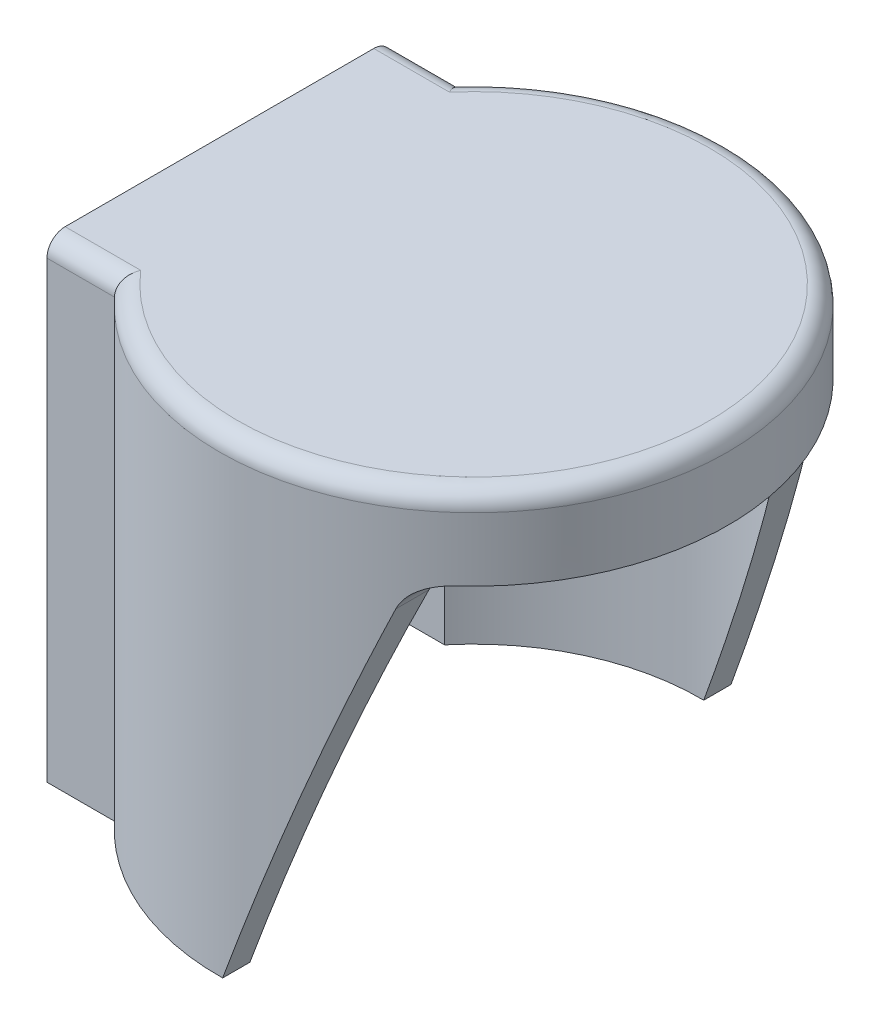
ISO-10303-21;
HEADER;
FILE_DESCRIPTION(('STEP AP214'),'2;1');
FILE_NAME('part.step','',(''),(''),'','','');
FILE_SCHEMA(('AUTOMOTIVE_DESIGN { 1 0 10303 214 1 1 1 1 }'));
ENDSEC;
DATA;
#1=APPLICATION_CONTEXT('core data for automotive mechanical design processes');
#2=APPLICATION_PROTOCOL_DEFINITION('international standard','automotive_design',2000,#1);
#3=PRODUCT_CONTEXT('',#1,'mechanical');
#4=PRODUCT('Part','Part','',(#3));
#5=PRODUCT_RELATED_PRODUCT_CATEGORY('part','',(#4));
#6=PRODUCT_DEFINITION_FORMATION('','',#4);
#7=PRODUCT_DEFINITION_CONTEXT('part definition',#1,'design');
#8=PRODUCT_DEFINITION('design','',#6,#7);
#9=PRODUCT_DEFINITION_SHAPE('','',#8);
#10=(LENGTH_UNIT() NAMED_UNIT(*) SI_UNIT(.MILLI.,.METRE.));
#11=(NAMED_UNIT(*) PLANE_ANGLE_UNIT() SI_UNIT($,.RADIAN.));
#12=(NAMED_UNIT(*) SI_UNIT($,.STERADIAN.) SOLID_ANGLE_UNIT());
#13=UNCERTAINTY_MEASURE_WITH_UNIT(LENGTH_MEASURE(1.E-05),#10,'distance_accuracy_value','');
#14=(GEOMETRIC_REPRESENTATION_CONTEXT(3) GLOBAL_UNCERTAINTY_ASSIGNED_CONTEXT((#13)) GLOBAL_UNIT_ASSIGNED_CONTEXT((#10,
#11,#12)) REPRESENTATION_CONTEXT('',''));
#15=CARTESIAN_POINT('',(0.,0.,0.));
#16=DIRECTION('',(0.,0.,1.));
#17=DIRECTION('',(1.,0.,0.));
#18=AXIS2_PLACEMENT_3D('',#15,#16,#17);
#19=CARTESIAN_POINT('',(0.,0.,0.));
#20=DIRECTION('',(0.,1.,0.));
#21=DIRECTION('',(0.,0.,1.));
#22=AXIS2_PLACEMENT_3D('',#19,#20,#21);
#23=PLANE('',#22);
#24=CARTESIAN_POINT('',(0.,0.,0.));
#25=DIRECTION('',(0.,1.,0.));
#26=DIRECTION('',(0.,0.,1.));
#27=AXIS2_PLACEMENT_3D('',#24,#25,#26);
#28=CIRCLE('',#27,14.);
#29=CARTESIAN_POINT('',(0.174639963276733,0.,-13.9989107034521));
#30=VERTEX_POINT('',#29);
#31=CARTESIAN_POINT('',(-10.2834819006016,0.,-9.5));
#32=VERTEX_POINT('',#31);
#33=EDGE_CURVE('E275',#30,#32,#28,.T.);
#34=ORIENTED_EDGE('',*,*,#33,.F.);
#35=DIRECTION('',(0.,0.,1.));
#36=VECTOR('',#35,1.);
#37=CARTESIAN_POINT('',(0.174639963276733,0.,-14.));
#38=LINE('',#37,#36);
#39=CARTESIAN_POINT('',(0.174639963276733,0.,-12.4987799757907));
#40=VERTEX_POINT('',#39);
#41=EDGE_CURVE('E165',#30,#40,#38,.T.);
#42=ORIENTED_EDGE('',*,*,#41,.T.);
#43=CARTESIAN_POINT('',(0.,0.,0.));
#44=DIRECTION('',(0.,1.,0.));
#45=DIRECTION('',(0.,0.,1.));
#46=AXIS2_PLACEMENT_3D('',#43,#44,#45);
#47=CIRCLE('',#46,12.5);
#48=CARTESIAN_POINT('',(-9.60468635614928,0.,-8.));
#49=VERTEX_POINT('',#48);
#50=EDGE_CURVE('E293',#40,#49,#47,.T.);
#51=ORIENTED_EDGE('',*,*,#50,.T.);
#52=DIRECTION('',(1.,0.,0.));
#53=VECTOR('',#52,1.);
#54=CARTESIAN_POINT('',(0.,0.,-8.));
#55=LINE('',#54,#53);
#56=CARTESIAN_POINT('',(-14.,0.,-8.));
#57=VERTEX_POINT('',#56);
#58=EDGE_CURVE('E352',#57,#49,#55,.T.);
#59=ORIENTED_EDGE('',*,*,#58,.F.);
#60=DIRECTION('',(0.,0.,-1.));
#61=VECTOR('',#60,1.);
#62=CARTESIAN_POINT('',(-14.,0.,9.5));
#63=LINE('',#62,#61);
#64=CARTESIAN_POINT('',(-14.,0.,-9.5));
#65=VERTEX_POINT('',#64);
#66=EDGE_CURVE('E347',#57,#65,#63,.T.);
#67=ORIENTED_EDGE('',*,*,#66,.T.);
#68=DIRECTION('',(1.,0.,0.));
#69=VECTOR('',#68,1.);
#70=CARTESIAN_POINT('',(0.,0.,-9.5));
#71=LINE('',#70,#69);
#72=EDGE_CURVE('E279',#65,#32,#71,.T.);
#73=ORIENTED_EDGE('',*,*,#72,.T.);
#74=EDGE_LOOP('',(#34,#42,#51,#59,#67,#73));
#75=FACE_BOUND('',#74,.T.);
#76=ADVANCED_FACE('F37',(#75),#23,.F.);
#77=CARTESIAN_POINT('',(-14.,0.,9.5));
#78=DIRECTION('',(1.,0.,0.));
#79=DIRECTION('',(0.,0.,-1.));
#80=AXIS2_PLACEMENT_3D('',#77,#78,#79);
#81=PLANE('',#80);
#82=DIRECTION('',(0.,0.,-1.));
#83=VECTOR('',#82,1.);
#84=CARTESIAN_POINT('',(-14.,26.,9.5));
#85=LINE('',#84,#83);
#86=CARTESIAN_POINT('',(-14.,26.,8.5));
#87=VERTEX_POINT('',#86);
#88=CARTESIAN_POINT('',(-14.,26.,-8.5));
#89=VERTEX_POINT('',#88);
#90=EDGE_CURVE('E358',#87,#89,#85,.T.);
#91=ORIENTED_EDGE('',*,*,#90,.T.);
#92=CARTESIAN_POINT('',(-14.,25.,-8.5));
#93=DIRECTION('',(1.,0.,0.));
#94=DIRECTION('',(0.,0.,-1.));
#95=AXIS2_PLACEMENT_3D('',#92,#93,#94);
#96=CIRCLE('',#95,1.);
#97=CARTESIAN_POINT('',(-14.,25.,-9.5));
#98=VERTEX_POINT('',#97);
#99=EDGE_CURVE('E308',#89,#98,#96,.F.);
#100=ORIENTED_EDGE('',*,*,#99,.T.);
#101=DIRECTION('',(0.,-1.,0.));
#102=VECTOR('',#101,1.);
#103=CARTESIAN_POINT('',(-14.,0.,-9.5));
#104=LINE('',#103,#102);
#105=EDGE_CURVE('E349',#98,#65,#104,.T.);
#106=ORIENTED_EDGE('',*,*,#105,.T.);
#107=ORIENTED_EDGE('',*,*,#66,.F.);
#108=DIRECTION('',(0.,-1.,0.));
#109=VECTOR('',#108,1.);
#110=CARTESIAN_POINT('',(-14.,0.,-8.));
#111=LINE('',#110,#109);
#112=CARTESIAN_POINT('',(-14.,24.5,-8.));
#113=VERTEX_POINT('',#112);
#114=EDGE_CURVE('E365',#113,#57,#111,.T.);
#115=ORIENTED_EDGE('',*,*,#114,.F.);
#116=DIRECTION('',(0.,0.,-1.));
#117=VECTOR('',#116,1.);
#118=CARTESIAN_POINT('',(-14.,24.5,0.));
#119=LINE('',#118,#117);
#120=CARTESIAN_POINT('',(-14.,24.5,8.));
#121=VERTEX_POINT('',#120);
#122=EDGE_CURVE('E373',#121,#113,#119,.T.);
#123=ORIENTED_EDGE('',*,*,#122,.F.);
#124=DIRECTION('',(0.,-1.,0.));
#125=VECTOR('',#124,1.);
#126=CARTESIAN_POINT('',(-14.,0.,8.));
#127=LINE('',#126,#125);
#128=CARTESIAN_POINT('',(-14.,0.,8.));
#129=VERTEX_POINT('',#128);
#130=EDGE_CURVE('E366',#121,#129,#127,.T.);
#131=ORIENTED_EDGE('',*,*,#130,.T.);
#132=CARTESIAN_POINT('',(-14.,0.,9.5));
#133=VERTEX_POINT('',#132);
#134=EDGE_CURVE('E343',#133,#129,#63,.T.);
#135=ORIENTED_EDGE('',*,*,#134,.F.);
#136=DIRECTION('',(0.,-1.,0.));
#137=VECTOR('',#136,1.);
#138=CARTESIAN_POINT('',(-14.,0.,9.5));
#139=LINE('',#138,#137);
#140=CARTESIAN_POINT('',(-14.,25.,9.5));
#141=VERTEX_POINT('',#140);
#142=EDGE_CURVE('E337',#141,#133,#139,.T.);
#143=ORIENTED_EDGE('',*,*,#142,.F.);
#144=CARTESIAN_POINT('',(-14.,25.,8.5));
#145=DIRECTION('',(1.,0.,0.));
#146=DIRECTION('',(0.,0.,-1.));
#147=AXIS2_PLACEMENT_3D('',#144,#145,#146);
#148=CIRCLE('',#147,1.);
#149=EDGE_CURVE('E306',#141,#87,#148,.F.);
#150=ORIENTED_EDGE('',*,*,#149,.T.);
#151=EDGE_LOOP('',(#91,#100,#106,#107,#115,#123,#131,#135,#143,#150));
#152=FACE_BOUND('',#151,.T.);
#153=ADVANCED_FACE('F255',(#152),#81,.F.);
#154=CARTESIAN_POINT('',(0.,26.,0.));
#155=DIRECTION('',(0.,-1.,0.));
#156=DIRECTION('',(0.,0.,-1.));
#157=AXIS2_PLACEMENT_3D('',#154,#155,#156);
#158=CYLINDRICAL_SURFACE('',#157,14.);
#159=DIRECTION('',(0.,-1.,0.));
#160=VECTOR('',#159,1.);
#161=CARTESIAN_POINT('',(-10.2834819006016,26.,-9.5));
#162=LINE('',#161,#160);
#163=CARTESIAN_POINT('',(-10.2834819006016,25.,-9.5));
#164=VERTEX_POINT('',#163);
#165=EDGE_CURVE('E284',#164,#32,#162,.T.);
#166=ORIENTED_EDGE('',*,*,#165,.F.);
#167=CARTESIAN_POINT('',(0.,25.,0.));
#168=DIRECTION('',(0.,1.,0.));
#169=DIRECTION('',(0.,0.,1.));
#170=AXIS2_PLACEMENT_3D('',#167,#168,#169);
#171=CIRCLE('',#170,14.);
#172=CARTESIAN_POINT('',(-10.2834819006016,25.,9.5));
#173=VERTEX_POINT('',#172);
#174=EDGE_CURVE('E11',#164,#173,#171,.F.);
#175=ORIENTED_EDGE('',*,*,#174,.T.);
#176=DIRECTION('',(0.,-1.,0.));
#177=VECTOR('',#176,1.);
#178=CARTESIAN_POINT('',(-10.2834819006016,26.,9.5));
#179=LINE('',#178,#177);
#180=CARTESIAN_POINT('',(-10.2834819006016,0.,9.5));
#181=VERTEX_POINT('',#180);
#182=EDGE_CURVE('E281',#173,#181,#179,.T.);
#183=ORIENTED_EDGE('',*,*,#182,.T.);
#184=CARTESIAN_POINT('',(0.174639963276733,0.,13.9989107034521));
#185=VERTEX_POINT('',#184);
#186=EDGE_CURVE('E280',#181,#185,#28,.T.);
#187=ORIENTED_EDGE('',*,*,#186,.T.);
#188=CARTESIAN_POINT('',(0.,-0.479819355637217,0.));
#189=DIRECTION('',(-0.93969262078591,0.342020143325666,0.));
#190=DIRECTION('',(-0.342020143325666,-0.93969262078591,0.));
#191=AXIS2_PLACEMENT_3D('',#188,#189,#190);
#192=ELLIPSE('',#191,40.9332616022836,14.);
#193=CARTESIAN_POINT('',(7.5210298348476,20.1840402866513,11.8082221449011));
#194=VERTEX_POINT('',#193);
#195=EDGE_CURVE('E370',#185,#194,#192,.T.);
#196=ORIENTED_EDGE('',*,*,#195,.T.);
#197=CARTESIAN_POINT('',(7.5210298348476,20.1840402866513,11.8082221449011));
#198=CARTESIAN_POINT('',(7.53964416121802,20.2352094824282,11.7963650266052));
#199=CARTESIAN_POINT('',(7.56025929357339,20.2853225516099,11.783173844617));
#200=CARTESIAN_POINT('',(7.60513088326993,20.3830827344216,11.7542631608349));
#201=CARTESIAN_POINT('',(7.62938448034597,20.430731745876,11.7385456443525));
#202=CARTESIAN_POINT('',(7.68104306748721,20.5230056304358,11.7048075369995));
#203=CARTESIAN_POINT('',(7.70842769372308,20.5676473460067,11.6868017518608));
#204=CARTESIAN_POINT('',(7.7660983294997,20.6539963784516,11.6485586344659));
#205=CARTESIAN_POINT('',(7.79638482730228,20.6957031994526,11.628320926585));
#206=CARTESIAN_POINT('',(7.89085962581988,20.8158972188824,11.564603905907));
#207=CARTESIAN_POINT('',(7.95886178942897,20.8898057763714,11.5179924339798));
#208=CARTESIAN_POINT('',(8.10216633661688,21.0245526320818,11.4176430613572));
#209=CARTESIAN_POINT('',(8.17747786945125,21.085374234826,11.3638961974131));
#210=CARTESIAN_POINT('',(8.34193129950177,21.2002367003342,11.2438290393299));
#211=CARTESIAN_POINT('',(8.43166197064205,21.2526603391434,11.1767734025499));
#212=CARTESIAN_POINT('',(8.61427254335412,21.3418272944479,11.0366485917379));
#213=CARTESIAN_POINT('',(8.70715675517663,21.3785481337333,10.9635709749076));
#214=CARTESIAN_POINT('',(8.90103567157139,21.4395241471304,10.8068593214908));
#215=CARTESIAN_POINT('',(9.00209566350913,21.4625772757445,10.7228467897591));
#216=CARTESIAN_POINT('',(9.20273060309242,21.4927709832532,10.5511819273745));
#217=CARTESIAN_POINT('',(9.30231022122739,21.4999836464836,10.4635479418198));
#218=CARTESIAN_POINT('',(9.40041507641943,21.5,10.3745937940252));
#219=B_SPLINE_CURVE_WITH_KNOTS('',3,(#197,#198,#199,#200,#201,#202,#203,#204,#205,#206,#207,
#208,#209,#210,#211,#212,#213,#214,#215,#216,#217,#218),.UNSPECIFIED.,.F.,.F.,(4,2,2,2,2,2,2,2,
2,2,4),(0.,0.167090234565998,0.334049798094063,0.499979394002213,0.665936958012112,
0.996605964460247,1.32769434791578,1.69738267648325,2.06759842507823,2.46681939068946,
2.86421984598594),.UNSPECIFIED.);
#220=CARTESIAN_POINT('',(9.40041507641944,21.5,10.3745937940252));
#221=VERTEX_POINT('',#220);
#222=EDGE_CURVE('E161',#194,#221,#219,.T.);
#223=ORIENTED_EDGE('',*,*,#222,.T.);
#224=CARTESIAN_POINT('',(0.,21.5,0.));
#225=DIRECTION('',(0.,1.,0.));
#226=DIRECTION('',(0.,0.,1.));
#227=AXIS2_PLACEMENT_3D('',#224,#225,#226);
#228=CIRCLE('',#227,14.);
#229=CARTESIAN_POINT('',(9.40041507641944,21.5,-10.3745937940252));
#230=VERTEX_POINT('',#229);
#231=EDGE_CURVE('E155',#221,#230,#228,.T.);
#232=ORIENTED_EDGE('',*,*,#231,.T.);
#233=CARTESIAN_POINT('',(9.40041507641944,21.5,-10.3745937940252));
#234=CARTESIAN_POINT('',(9.33795212595386,21.4999945214225,-10.4311998485813));
#235=CARTESIAN_POINT('',(9.27495096262056,21.4970724438754,-10.4872495153663));
#236=CARTESIAN_POINT('',(9.14820219496933,21.4850576544909,-10.5979924235593));
#237=CARTESIAN_POINT('',(9.08445369550329,21.4759565933134,-10.6526837256943));
#238=CARTESIAN_POINT('',(8.95622221058412,21.4511499382536,-10.7607236013025));
#239=CARTESIAN_POINT('',(8.89173734010608,21.4353942701503,-10.8140586745226));
#240=CARTESIAN_POINT('',(8.76313337993291,21.3969388282564,-10.9185329760418));
#241=CARTESIAN_POINT('',(8.69901410254167,21.3742430213509,-10.9696734397557));
#242=CARTESIAN_POINT('',(8.53432969973797,21.3060583961757,-11.0987217670025));
#243=CARTESIAN_POINT('',(8.43447336093399,21.2550112438014,-11.1747129779921));
#244=CARTESIAN_POINT('',(8.24094338114474,21.1335899521312,-11.3181853811845));
#245=CARTESIAN_POINT('',(8.14725242599497,21.0632730759382,-11.3856909362228));
#246=CARTESIAN_POINT('',(7.9840136391063,20.9156145437415,-11.5006046992267));
#247=CARTESIAN_POINT('',(7.91298009415029,20.8410831155087,-11.5495051731489));
#248=CARTESIAN_POINT('',(7.7813660934855,20.6787894039009,-11.6385843936173));
#249=CARTESIAN_POINT('',(7.72076853117131,20.5910492234563,-11.6787774417764));
#250=CARTESIAN_POINT('',(7.63860351371989,20.4482980233732,-11.7325572204531));
#251=CARTESIAN_POINT('',(7.61211864450436,20.397398703656,-11.7497448772734));
#252=CARTESIAN_POINT('',(7.56333400259621,20.2927604434087,-11.7812057399427));
#253=CARTESIAN_POINT('',(7.54103518459539,20.2390208586861,-11.7954782810209));
#254=CARTESIAN_POINT('',(7.52102983484761,20.1840402866513,-11.8082221449011));
#255=B_SPLINE_CURVE_WITH_KNOTS('',3,(#233,#234,#235,#236,#237,#238,#239,#240,#241,#242,#243,
#244,#245,#246,#247,#248,#249,#250,#251,#252,#253,#254),.UNSPECIFIED.,.F.,.F.,(4,2,2,2,2,2,2,2,
2,2,4),(0.,0.252871692749005,0.506085759745772,0.761240132326026,1.01624893402829,
1.42100688096779,1.82457482860889,2.1651425670201,2.50514662231578,2.68458223283801,
2.86405871675947),.UNSPECIFIED.);
#256=CARTESIAN_POINT('',(7.5210298348476,20.1840402866513,-11.8082221449011));
#257=VERTEX_POINT('',#256);
#258=EDGE_CURVE('E159',#230,#257,#255,.T.);
#259=ORIENTED_EDGE('',*,*,#258,.T.);
#260=EDGE_CURVE('E289',#257,#30,#192,.T.);
#261=ORIENTED_EDGE('',*,*,#260,.T.);
#262=ORIENTED_EDGE('',*,*,#33,.T.);
#263=EDGE_LOOP('',(#166,#175,#183,#187,#196,#223,#232,#259,#261,#262));
#264=FACE_BOUND('',#263,.T.);
#265=ADVANCED_FACE('F157',(#264),#158,.T.);
#266=CARTESIAN_POINT('',(0.,26.,0.));
#267=DIRECTION('',(0.,1.,0.));
#268=DIRECTION('',(0.,0.,1.));
#269=AXIS2_PLACEMENT_3D('',#266,#267,#268);
#270=PLANE('',#269);
#271=CARTESIAN_POINT('',(0.,26.,0.));
#272=DIRECTION('',(0.,1.,0.));
#273=DIRECTION('',(0.,0.,1.));
#274=AXIS2_PLACEMENT_3D('',#271,#272,#273);
#275=CIRCLE('',#274,13.);
#276=CARTESIAN_POINT('',(-9.83615778645304,26.,8.49999999999996));
#277=VERTEX_POINT('',#276);
#278=CARTESIAN_POINT('',(-9.83615778645304,26.,-8.49999999999996));
#279=VERTEX_POINT('',#278);
#280=EDGE_CURVE('E295',#277,#279,#275,.T.);
#281=ORIENTED_EDGE('',*,*,#280,.T.);
#282=DIRECTION('',(-1.,0.,0.));
#283=VECTOR('',#282,1.);
#284=CARTESIAN_POINT('',(-14.,26.,-8.5));
#285=LINE('',#284,#283);
#286=EDGE_CURVE('E302',#279,#89,#285,.T.);
#287=ORIENTED_EDGE('',*,*,#286,.T.);
#288=ORIENTED_EDGE('',*,*,#90,.F.);
#289=DIRECTION('',(-1.,0.,0.));
#290=VECTOR('',#289,1.);
#291=CARTESIAN_POINT('',(0.,26.,8.5));
#292=LINE('',#291,#290);
#293=EDGE_CURVE('E298',#87,#277,#292,.F.);
#294=ORIENTED_EDGE('',*,*,#293,.T.);
#295=EDGE_LOOP('',(#281,#287,#288,#294));
#296=FACE_BOUND('',#295,.T.);
#297=ADVANCED_FACE('F259',(#296),#270,.T.);
#298=CARTESIAN_POINT('',(-9.60468635614928,0.,8.));
#299=VERTEX_POINT('',#298);
#300=CARTESIAN_POINT('',(0.174639963276733,0.,12.4987799757907));
#301=VERTEX_POINT('',#300);
#302=EDGE_CURVE('E380',#299,#301,#47,.T.);
#303=ORIENTED_EDGE('',*,*,#302,.T.);
#304=EDGE_CURVE('E290',#301,#185,#38,.T.);
#305=ORIENTED_EDGE('',*,*,#304,.T.);
#306=ORIENTED_EDGE('',*,*,#186,.F.);
#307=DIRECTION('',(1.,0.,0.));
#308=VECTOR('',#307,1.);
#309=CARTESIAN_POINT('',(0.,0.,9.5));
#310=LINE('',#309,#308);
#311=EDGE_CURVE('E345',#133,#181,#310,.T.);
#312=ORIENTED_EDGE('',*,*,#311,.F.);
#313=ORIENTED_EDGE('',*,*,#134,.T.);
#314=DIRECTION('',(1.,0.,0.));
#315=VECTOR('',#314,1.);
#316=CARTESIAN_POINT('',(0.,0.,8.));
#317=LINE('',#316,#315);
#318=EDGE_CURVE('E376',#129,#299,#317,.T.);
#319=ORIENTED_EDGE('',*,*,#318,.T.);
#320=EDGE_LOOP('',(#303,#305,#306,#312,#313,#319));
#321=FACE_BOUND('',#320,.T.);
#322=ADVANCED_FACE('F251',(#321),#23,.F.);
#323=CARTESIAN_POINT('',(0.,0.,9.5));
#324=DIRECTION('',(0.,0.,1.));
#325=DIRECTION('',(1.,0.,0.));
#326=AXIS2_PLACEMENT_3D('',#323,#324,#325);
#327=PLANE('',#326);
#328=ORIENTED_EDGE('',*,*,#182,.F.);
#329=DIRECTION('',(-1.,0.,0.));
#330=VECTOR('',#329,1.);
#331=CARTESIAN_POINT('',(0.,25.,9.5));
#332=LINE('',#331,#330);
#333=EDGE_CURVE('E51',#173,#141,#332,.T.);
#334=ORIENTED_EDGE('',*,*,#333,.T.);
#335=ORIENTED_EDGE('',*,*,#142,.T.);
#336=ORIENTED_EDGE('',*,*,#311,.T.);
#337=EDGE_LOOP('',(#328,#334,#335,#336));
#338=FACE_BOUND('',#337,.T.);
#339=ADVANCED_FACE('F248',(#338),#327,.T.);
#340=CARTESIAN_POINT('',(0.,0.,-9.5));
#341=DIRECTION('',(0.,0.,1.));
#342=DIRECTION('',(1.,0.,0.));
#343=AXIS2_PLACEMENT_3D('',#340,#341,#342);
#344=PLANE('',#343);
#345=ORIENTED_EDGE('',*,*,#105,.F.);
#346=DIRECTION('',(-1.,0.,0.));
#347=VECTOR('',#346,1.);
#348=CARTESIAN_POINT('',(-10.2834819006016,25.,-9.5));
#349=LINE('',#348,#347);
#350=EDGE_CURVE('E65',#98,#164,#349,.F.);
#351=ORIENTED_EDGE('',*,*,#350,.T.);
#352=ORIENTED_EDGE('',*,*,#165,.T.);
#353=ORIENTED_EDGE('',*,*,#72,.F.);
#354=EDGE_LOOP('',(#345,#351,#352,#353));
#355=FACE_BOUND('',#354,.T.);
#356=ADVANCED_FACE('F234',(#355),#344,.F.);
#357=CARTESIAN_POINT('',(0.,26.,0.));
#358=DIRECTION('',(0.,-1.,0.));
#359=DIRECTION('',(0.,0.,-1.));
#360=AXIS2_PLACEMENT_3D('',#357,#358,#359);
#361=CYLINDRICAL_SURFACE('',#360,12.5);
#362=CARTESIAN_POINT('',(0.,-0.479819355637217,0.));
#363=DIRECTION('',(-0.93969262078591,0.342020143325666,0.));
#364=DIRECTION('',(-0.342020143325666,-0.93969262078591,0.));
#365=AXIS2_PLACEMENT_3D('',#362,#363,#364);
#366=ELLIPSE('',#365,36.5475550020389,12.5);
#367=CARTESIAN_POINT('',(7.5210298348476,20.1840402866513,9.98419301813283));
#368=VERTEX_POINT('',#367);
#369=EDGE_CURVE('E294',#301,#368,#366,.T.);
#370=ORIENTED_EDGE('',*,*,#369,.F.);
#371=ORIENTED_EDGE('',*,*,#302,.F.);
#372=DIRECTION('',(0.,-1.,0.));
#373=VECTOR('',#372,1.);
#374=CARTESIAN_POINT('',(-9.60468635614928,24.5,8.));
#375=LINE('',#374,#373);
#376=CARTESIAN_POINT('',(-9.60468635614928,24.5,8.));
#377=VERTEX_POINT('',#376);
#378=EDGE_CURVE('E383',#377,#299,#375,.T.);
#379=ORIENTED_EDGE('',*,*,#378,.F.);
#380=CARTESIAN_POINT('',(0.,24.5,0.));
#381=DIRECTION('',(0.,1.,0.));
#382=DIRECTION('',(0.,0.,1.));
#383=AXIS2_PLACEMENT_3D('',#380,#381,#382);
#384=CIRCLE('',#383,12.5);
#385=CARTESIAN_POINT('',(-9.60468635614928,24.5,-8.));
#386=VERTEX_POINT('',#385);
#387=EDGE_CURVE('E355',#377,#386,#384,.T.);
#388=ORIENTED_EDGE('',*,*,#387,.T.);
#389=DIRECTION('',(0.,-1.,0.));
#390=VECTOR('',#389,1.);
#391=CARTESIAN_POINT('',(-9.60468635614928,24.5,-8.));
#392=LINE('',#391,#390);
#393=EDGE_CURVE('E375',#386,#49,#392,.T.);
#394=ORIENTED_EDGE('',*,*,#393,.T.);
#395=ORIENTED_EDGE('',*,*,#50,.F.);
#396=CARTESIAN_POINT('',(7.5210298348476,20.1840402866513,-9.98419301813283));
#397=VERTEX_POINT('',#396);
#398=EDGE_CURVE('E227',#397,#40,#366,.T.);
#399=ORIENTED_EDGE('',*,*,#398,.F.);
#400=CARTESIAN_POINT('',(9.40041507641944,21.5,-8.23906526197154));
#401=CARTESIAN_POINT('',(9.33134105498748,21.499984116413,-8.31789425667587));
#402=CARTESIAN_POINT('',(9.26121912405547,21.4964182611215,-8.39588216924079));
#403=CARTESIAN_POINT('',(9.1192451697094,21.4814319987808,-8.54987045488769));
#404=CARTESIAN_POINT('',(9.04738899786413,21.4699904778331,-8.62586491379376));
#405=CARTESIAN_POINT('',(8.90190250787866,21.4383189292312,-8.77594349709575));
#406=CARTESIAN_POINT('',(8.82826139173239,21.4179945872011,-8.8499978204644));
#407=CARTESIAN_POINT('',(8.68093689278034,21.3677268928209,-8.99455248050032));
#408=CARTESIAN_POINT('',(8.60725366916202,21.3377952191737,-9.06505701253942));
#409=CARTESIAN_POINT('',(8.44082839814861,21.257808708376,-9.22055558115811));
#410=CARTESIAN_POINT('',(8.34838508532501,21.2044892039932,-9.30423899400981));
#411=CARTESIAN_POINT('',(8.16866906280989,21.0794668707845,-9.4624048874885));
#412=CARTESIAN_POINT('',(8.08137861656984,21.0078322500895,-9.53692001901233));
#413=CARTESIAN_POINT('',(7.92999519674874,20.8591017850868,-9.66298158777884));
#414=CARTESIAN_POINT('',(7.86447164944451,20.7849592072767,-9.71628265690848));
#415=CARTESIAN_POINT('',(7.7429500983497,20.6238045722391,-9.81339697219528));
#416=CARTESIAN_POINT('',(7.68693373651391,20.5368179384009,-9.85722854935347));
#417=CARTESIAN_POINT('',(7.61523686090706,20.4029619519664,-9.91256555756768));
#418=CARTESIAN_POINT('',(7.59441205258384,20.3605896659058,-9.92852000060317));
#419=CARTESIAN_POINT('',(7.55555945226821,20.2738004758671,-9.95811781205938));
#420=CARTESIAN_POINT('',(7.53753197995155,20.2293833389571,-9.97176091635978));
#421=CARTESIAN_POINT('',(7.5210298348476,20.1840402866513,-9.98419301813283));
#422=B_SPLINE_CURVE_WITH_KNOTS('',3,(#400,#401,#402,#403,#404,#405,#406,#407,#408,#409,#410,
#411,#412,#413,#414,#415,#416,#417,#418,#419,#420,#421),.UNSPECIFIED.,.F.,.F.,(4,2,2,2,2,2,2,2,
2,2,4),(0.,0.314449411809667,0.629745132276263,0.948473109132464,1.26681509732919,
1.67221840408546,2.07613338028545,2.41199984165814,2.74721018991175,2.89656843045971,
3.04594372691391),.UNSPECIFIED.);
#423=CARTESIAN_POINT('',(9.40041507641944,21.5,-8.23906526197154));
#424=VERTEX_POINT('',#423);
#425=EDGE_CURVE('E212',#424,#397,#422,.T.);
#426=ORIENTED_EDGE('',*,*,#425,.F.);
#427=CARTESIAN_POINT('',(0.,21.5,0.));
#428=DIRECTION('',(0.,1.,0.));
#429=DIRECTION('',(0.,0.,1.));
#430=AXIS2_PLACEMENT_3D('',#427,#428,#429);
#431=CIRCLE('',#430,12.5);
#432=CARTESIAN_POINT('',(9.40041507641944,21.5,8.23906526197154));
#433=VERTEX_POINT('',#432);
#434=EDGE_CURVE('E178',#433,#424,#431,.T.);
#435=ORIENTED_EDGE('',*,*,#434,.F.);
#436=CARTESIAN_POINT('',(7.5210298348476,20.1840402866513,9.98419301813283));
#437=CARTESIAN_POINT('',(7.53948517440466,20.2347735663476,9.97028985678865));
#438=CARTESIAN_POINT('',(7.55986863560799,20.2843599089869,9.95485588682352));
#439=CARTESIAN_POINT('',(7.60407704292878,20.3808942295186,9.92112840228522));
#440=CARTESIAN_POINT('',(7.62789837722727,20.4278449054112,9.90283788715306));
#441=CARTESIAN_POINT('',(7.6784099509673,20.518515118071,9.86372290322524));
#442=CARTESIAN_POINT('',(7.70507633929395,20.5622570200279,9.84291933326059));
#443=CARTESIAN_POINT('',(7.76102769080538,20.6467250278231,9.79886332856466));
#444=CARTESIAN_POINT('',(7.79031328513185,20.687450402433,9.77561030335468));
#445=CARTESIAN_POINT('',(7.88125798227418,20.8045639419319,9.70266757771394));
#446=CARTESIAN_POINT('',(7.94625617219056,20.8763295018763,9.64960188694123));
#447=CARTESIAN_POINT('',(8.08229097506071,21.00714879296,9.53595717510099));
#448=CARTESIAN_POINT('',(8.1533394445416,21.0661767241207,9.47536328950627));
#449=CARTESIAN_POINT('',(8.33356510884439,21.1968830519338,9.31782681688415));
#450=CARTESIAN_POINT('',(8.44485883187699,21.2613050934843,9.21726431945279));
#451=CARTESIAN_POINT('',(8.66964603963286,21.3658573506708,9.00617453834188));
#452=CARTESIAN_POINT('',(8.7831450864486,21.40591468268,8.8956184822808));
#453=CARTESIAN_POINT('',(8.98187749599574,21.457742531765,8.69430423177076));
#454=CARTESIAN_POINT('',(9.06748909824702,21.4739468532104,8.60499413835789));
#455=CARTESIAN_POINT('',(9.23601977746981,21.4950168118687,8.42385084832009));
#456=CARTESIAN_POINT('',(9.3189546029712,21.4999695416689,8.33204263729203));
#457=CARTESIAN_POINT('',(9.40041507641943,21.5,8.23906526197154));
#458=B_SPLINE_CURVE_WITH_KNOTS('',3,(#436,#437,#438,#439,#440,#441,#442,#443,#444,#445,#446,
#447,#448,#449,#450,#451,#452,#453,#454,#455,#456,#457),.UNSPECIFIED.,.F.,.F.,(4,2,2,2,2,2,2,2,
2,2,4),(0.,0.167141576939942,0.334108816768244,0.499772456803048,0.665476124386676,
0.995277356424253,1.32574045546474,1.8127706760521,2.3012507050539,2.67501177157983,
3.0458697491439),.UNSPECIFIED.);
#459=EDGE_CURVE('E220',#368,#433,#458,.T.);
#460=ORIENTED_EDGE('',*,*,#459,.F.);
#461=EDGE_LOOP('',(#370,#371,#379,#388,#394,#395,#399,#426,#435,#460));
#462=FACE_BOUND('',#461,.T.);
#463=ADVANCED_FACE('F229',(#462),#361,.F.);
#464=CARTESIAN_POINT('',(0.,24.5,0.));
#465=DIRECTION('',(0.,1.,0.));
#466=DIRECTION('',(0.,0.,1.));
#467=AXIS2_PLACEMENT_3D('',#464,#465,#466);
#468=PLANE('',#467);
#469=DIRECTION('',(-1.,0.,0.));
#470=VECTOR('',#469,1.);
#471=CARTESIAN_POINT('',(0.,24.5,-8.));
#472=LINE('',#471,#470);
#473=EDGE_CURVE('E368',#386,#113,#472,.T.);
#474=ORIENTED_EDGE('',*,*,#473,.F.);
#475=ORIENTED_EDGE('',*,*,#387,.F.);
#476=DIRECTION('',(-1.,0.,0.));
#477=VECTOR('',#476,1.);
#478=CARTESIAN_POINT('',(0.,24.5,8.));
#479=LINE('',#478,#477);
#480=EDGE_CURVE('E364',#377,#121,#479,.T.);
#481=ORIENTED_EDGE('',*,*,#480,.T.);
#482=ORIENTED_EDGE('',*,*,#122,.T.);
#483=EDGE_LOOP('',(#474,#475,#481,#482));
#484=FACE_BOUND('',#483,.T.);
#485=ADVANCED_FACE('F233',(#484),#468,.F.);
#486=CARTESIAN_POINT('',(0.,0.,8.));
#487=DIRECTION('',(0.,0.,1.));
#488=DIRECTION('',(1.,0.,0.));
#489=AXIS2_PLACEMENT_3D('',#486,#487,#488);
#490=PLANE('',#489);
#491=ORIENTED_EDGE('',*,*,#378,.T.);
#492=ORIENTED_EDGE('',*,*,#318,.F.);
#493=ORIENTED_EDGE('',*,*,#130,.F.);
#494=ORIENTED_EDGE('',*,*,#480,.F.);
#495=EDGE_LOOP('',(#491,#492,#493,#494));
#496=FACE_BOUND('',#495,.T.);
#497=ADVANCED_FACE('F239',(#496),#490,.F.);
#498=CARTESIAN_POINT('',(0.,0.,-8.));
#499=DIRECTION('',(0.,0.,1.));
#500=DIRECTION('',(1.,0.,0.));
#501=AXIS2_PLACEMENT_3D('',#498,#499,#500);
#502=PLANE('',#501);
#503=ORIENTED_EDGE('',*,*,#473,.T.);
#504=ORIENTED_EDGE('',*,*,#114,.T.);
#505=ORIENTED_EDGE('',*,*,#58,.T.);
#506=ORIENTED_EDGE('',*,*,#393,.F.);
#507=EDGE_LOOP('',(#503,#504,#505,#506));
#508=FACE_BOUND('',#507,.T.);
#509=ADVANCED_FACE('F243',(#508),#502,.T.);
#510=CARTESIAN_POINT('',(0.174639963276733,0.,-14.));
#511=DIRECTION('',(-0.93969262078591,0.342020143325666,0.));
#512=DIRECTION('',(-0.342020143325666,-0.93969262078591,0.));
#513=AXIS2_PLACEMENT_3D('',#510,#511,#512);
#514=PLANE('',#513);
#515=ORIENTED_EDGE('',*,*,#304,.F.);
#516=ORIENTED_EDGE('',*,*,#369,.T.);
#517=DIRECTION('',(0.,0.,1.));
#518=VECTOR('',#517,1.);
#519=CARTESIAN_POINT('',(7.5210298348476,20.1840402866513,-14.));
#520=LINE('',#519,#518);
#521=EDGE_CURVE('E179',#368,#194,#520,.T.);
#522=ORIENTED_EDGE('',*,*,#521,.T.);
#523=ORIENTED_EDGE('',*,*,#195,.F.);
#524=EDGE_LOOP('',(#515,#516,#522,#523));
#525=FACE_BOUND('',#524,.T.);
#526=ADVANCED_FACE('F207',(#525),#514,.F.);
#527=EDGE_CURVE('E174',#257,#397,#520,.T.);
#528=ORIENTED_EDGE('',*,*,#527,.T.);
#529=ORIENTED_EDGE('',*,*,#398,.T.);
#530=ORIENTED_EDGE('',*,*,#41,.F.);
#531=ORIENTED_EDGE('',*,*,#260,.F.);
#532=EDGE_LOOP('',(#528,#529,#530,#531));
#533=FACE_BOUND('',#532,.T.);
#534=ADVANCED_FACE('F205',(#533),#514,.F.);
#535=CARTESIAN_POINT('',(9.40041507641943,19.5,-14.));
#536=DIRECTION('',(0.,0.,1.));
#537=DIRECTION('',(1.,0.,0.));
#538=AXIS2_PLACEMENT_3D('',#535,#536,#537);
#539=CYLINDRICAL_SURFACE('',#538,2.);
#540=ORIENTED_EDGE('',*,*,#521,.F.);
#541=ORIENTED_EDGE('',*,*,#459,.T.);
#542=DIRECTION('',(0.,0.,1.));
#543=VECTOR('',#542,1.);
#544=CARTESIAN_POINT('',(9.40041507641944,21.5,-14.));
#545=LINE('',#544,#543);
#546=EDGE_CURVE('E180',#433,#221,#545,.T.);
#547=ORIENTED_EDGE('',*,*,#546,.T.);
#548=ORIENTED_EDGE('',*,*,#222,.F.);
#549=EDGE_LOOP('',(#540,#541,#547,#548));
#550=FACE_BOUND('',#549,.T.);
#551=ADVANCED_FACE('F200',(#550),#539,.F.);
#552=EDGE_CURVE('E171',#230,#424,#545,.T.);
#553=ORIENTED_EDGE('',*,*,#552,.T.);
#554=ORIENTED_EDGE('',*,*,#425,.T.);
#555=ORIENTED_EDGE('',*,*,#527,.F.);
#556=ORIENTED_EDGE('',*,*,#258,.F.);
#557=EDGE_LOOP('',(#553,#554,#555,#556));
#558=FACE_BOUND('',#557,.T.);
#559=ADVANCED_FACE('F170',(#558),#539,.F.);
#560=CARTESIAN_POINT('',(9.40041507641944,21.5,-14.));
#561=DIRECTION('',(0.,1.,0.));
#562=DIRECTION('',(0.,0.,1.));
#563=AXIS2_PLACEMENT_3D('',#560,#561,#562);
#564=PLANE('',#563);
#565=ORIENTED_EDGE('',*,*,#546,.F.);
#566=ORIENTED_EDGE('',*,*,#434,.T.);
#567=ORIENTED_EDGE('',*,*,#552,.F.);
#568=ORIENTED_EDGE('',*,*,#231,.F.);
#569=EDGE_LOOP('',(#565,#566,#567,#568));
#570=FACE_BOUND('',#569,.T.);
#571=ADVANCED_FACE('F176',(#570),#564,.F.);
#572=CARTESIAN_POINT('',(0.,25.,8.5));
#573=DIRECTION('',(-1.,0.,0.));
#574=DIRECTION('',(0.,0.,1.));
#575=AXIS2_PLACEMENT_3D('',#572,#573,#574);
#576=CYLINDRICAL_SURFACE('',#575,1.);
#577=ORIENTED_EDGE('',*,*,#149,.F.);
#578=ORIENTED_EDGE('',*,*,#333,.F.);
#579=CARTESIAN_POINT('',(-10.2834819006016,25.,9.5));
#580=CARTESIAN_POINT('',(-10.283482215541,25.0264175952982,9.50000094920324));
#581=CARTESIAN_POINT('',(-10.2830234936004,25.0528218955528,9.49895241689073));
#582=CARTESIAN_POINT('',(-10.2811961351482,25.1054283408039,9.49477696860874));
#583=CARTESIAN_POINT('',(-10.2798276937185,25.1316305279236,9.49165049823604));
#584=CARTESIAN_POINT('',(-10.2743835026095,25.2094906940835,9.47921582083135));
#585=CARTESIAN_POINT('',(-10.268968740629,25.2606048367697,9.46685198760637));
#586=CARTESIAN_POINT('',(-10.2547769822448,25.3598001066668,9.43448903998783));
#587=CARTESIAN_POINT('',(-10.2460010730646,25.4078822087947,9.4144923945717));
#588=CARTESIAN_POINT('',(-10.225399703399,25.4998790689603,9.36763259069195));
#589=CARTESIAN_POINT('',(-10.2135729620084,25.5437920659611,9.34076654812363));
#590=CARTESIAN_POINT('',(-10.1868153024132,25.627852396137,9.28011351759851));
#591=CARTESIAN_POINT('',(-10.1717941526031,25.6678257042311,9.24612590443563));
#592=CARTESIAN_POINT('',(-10.1393611912567,25.741527473688,9.17293139569374));
#593=CARTESIAN_POINT('',(-10.1219486510781,25.7752540243172,9.1337229094574));
#594=CARTESIAN_POINT('',(-10.0837319298392,25.838357679908,9.04791740683499));
#595=CARTESIAN_POINT('',(-10.0627681555148,25.8671756967844,9.0009807922835));
#596=CARTESIAN_POINT('',(-10.0191494081955,25.916538748708,8.90365326528037));
#597=CARTESIAN_POINT('',(-9.99649359004851,25.9370796162317,8.85326062763452));
#598=CARTESIAN_POINT('',(-9.95161022773977,25.9685716792459,8.75378623897206));
#599=CARTESIAN_POINT('',(-9.92945593237521,25.9800738065216,8.70484337445255));
#600=CARTESIAN_POINT('',(-9.8846098389853,25.9956049586247,8.60611231368289));
#601=CARTESIAN_POINT('',(-9.861919221234,25.9996490809772,8.55632603156417));
#602=CARTESIAN_POINT('',(-9.83817420241431,25.9999927299003,8.50440784416129));
#603=CARTESIAN_POINT('',(-9.83716602932671,26.0000000164536,8.50220382739862));
#604=CARTESIAN_POINT('',(-9.836157786453,26.,8.5));
#605=B_SPLINE_CURVE_WITH_KNOTS('',3,(#579,#580,#581,#582,#583,#584,#585,#586,#587,#588,#589,
#590,#591,#592,#593,#594,#595,#596,#597,#598,#599,#600,#601,#602,#603,#604),.UNSPECIFIED.,.F.,
.F.,(4,2,2,2,2,2,2,2,2,2,2,2,4),(0.,0.079201925412234,0.158386872098074,0.316157157707684,
0.473876452723804,0.631662074961268,0.794700396855983,0.957788506215315,1.13384458734409,
1.30998920182902,1.47431584798578,1.63830947471536,1.64558042025684),.UNSPECIFIED.);
#606=EDGE_CURVE('E42',#277,#173,#605,.F.);
#607=ORIENTED_EDGE('',*,*,#606,.F.);
#608=ORIENTED_EDGE('',*,*,#293,.F.);
#609=EDGE_LOOP('',(#577,#578,#607,#608));
#610=FACE_BOUND('',#609,.T.);
#611=ADVANCED_FACE('F39',(#610),#576,.T.);
#612=CARTESIAN_POINT('',(0.,25.,0.));
#613=DIRECTION('',(0.,1.,0.));
#614=DIRECTION('',(0.,0.,1.));
#615=AXIS2_PLACEMENT_3D('',#612,#613,#614);
#616=TOROIDAL_SURFACE('',#615,13.,1.);
#617=ORIENTED_EDGE('',*,*,#606,.T.);
#618=ORIENTED_EDGE('',*,*,#174,.F.);
#619=CARTESIAN_POINT('',(-10.2834819006016,25.,-9.5));
#620=CARTESIAN_POINT('',(-10.283482215541,25.0264175952982,-9.50000094920324));
#621=CARTESIAN_POINT('',(-10.2830234936004,25.0528218955528,-9.49895241689073));
#622=CARTESIAN_POINT('',(-10.2811961351482,25.1054283408039,-9.49477696860874));
#623=CARTESIAN_POINT('',(-10.2798276937185,25.1316305279236,-9.49165049823604));
#624=CARTESIAN_POINT('',(-10.2743835026095,25.2094906940835,-9.47921582083135));
#625=CARTESIAN_POINT('',(-10.268968740629,25.2606048367697,-9.46685198760637));
#626=CARTESIAN_POINT('',(-10.2547769822448,25.3598001066668,-9.43448903998783));
#627=CARTESIAN_POINT('',(-10.2460010730646,25.4078822087947,-9.4144923945717));
#628=CARTESIAN_POINT('',(-10.225399703399,25.4998790689603,-9.36763259069195));
#629=CARTESIAN_POINT('',(-10.2135729620084,25.5437920659611,-9.34076654812363));
#630=CARTESIAN_POINT('',(-10.1868153024132,25.627852396137,-9.28011351759851));
#631=CARTESIAN_POINT('',(-10.1717941526031,25.6678257042311,-9.24612590443563));
#632=CARTESIAN_POINT('',(-10.1393611912567,25.741527473688,-9.17293139569374));
#633=CARTESIAN_POINT('',(-10.1219486510781,25.7752540243172,-9.1337229094574));
#634=CARTESIAN_POINT('',(-10.0837319298392,25.838357679908,-9.04791740683499));
#635=CARTESIAN_POINT('',(-10.0627681555148,25.8671756967844,-9.0009807922835));
#636=CARTESIAN_POINT('',(-10.0191494081955,25.916538748708,-8.90365326528037));
#637=CARTESIAN_POINT('',(-9.99649359004851,25.9370796162317,-8.85326062763452));
#638=CARTESIAN_POINT('',(-9.95161022773977,25.9685716792459,-8.75378623897206));
#639=CARTESIAN_POINT('',(-9.92945593237521,25.9800738065216,-8.70484337445255));
#640=CARTESIAN_POINT('',(-9.8846098389853,25.9956049586247,-8.60611231368289));
#641=CARTESIAN_POINT('',(-9.861919221234,25.9996490809772,-8.55632603156417));
#642=CARTESIAN_POINT('',(-9.83817420241431,25.9999927299003,-8.50440784416129));
#643=CARTESIAN_POINT('',(-9.83716602932671,26.0000000164536,-8.50220382739862));
#644=CARTESIAN_POINT('',(-9.836157786453,26.,-8.5));
#645=B_SPLINE_CURVE_WITH_KNOTS('',3,(#619,#620,#621,#622,#623,#624,#625,#626,#627,#628,#629,
#630,#631,#632,#633,#634,#635,#636,#637,#638,#639,#640,#641,#642,#643,#644),.UNSPECIFIED.,.F.,
.F.,(4,2,2,2,2,2,2,2,2,2,2,2,4),(0.,0.079201925412234,0.158386872098074,0.316157157707684,
0.473876452723804,0.631662074961268,0.794700396855983,0.957788506215315,1.13384458734409,
1.30998920182902,1.47431584798578,1.63830947471536,1.64558042025684),.UNSPECIFIED.);
#646=EDGE_CURVE('E311',#279,#164,#645,.F.);
#647=ORIENTED_EDGE('',*,*,#646,.F.);
#648=ORIENTED_EDGE('',*,*,#280,.F.);
#649=EDGE_LOOP('',(#617,#618,#647,#648));
#650=FACE_BOUND('',#649,.T.);
#651=ADVANCED_FACE('F319',(#650),#616,.T.);
#652=CARTESIAN_POINT('',(0.,25.,-8.5));
#653=DIRECTION('',(1.,0.,0.));
#654=DIRECTION('',(0.,0.,-1.));
#655=AXIS2_PLACEMENT_3D('',#652,#653,#654);
#656=CYLINDRICAL_SURFACE('',#655,1.);
#657=ORIENTED_EDGE('',*,*,#646,.T.);
#658=ORIENTED_EDGE('',*,*,#350,.F.);
#659=ORIENTED_EDGE('',*,*,#99,.F.);
#660=ORIENTED_EDGE('',*,*,#286,.F.);
#661=EDGE_LOOP('',(#657,#658,#659,#660));
#662=FACE_BOUND('',#661,.T.);
#663=ADVANCED_FACE('F317',(#662),#656,.T.);
#664=CLOSED_SHELL('',(#76,#153,#265,#297,#322,#339,#356,#463,#485,#497,#509,#526,#534,#551,#559,
#571,#611,#651,#663));
#665=MANIFOLD_SOLID_BREP('B2',#664);
#666=ADVANCED_BREP_SHAPE_REPRESENTATION('',(#18,#665),#14);
#667=SHAPE_DEFINITION_REPRESENTATION(#9,#666);
ENDSEC;
END-ISO-10303-21;
